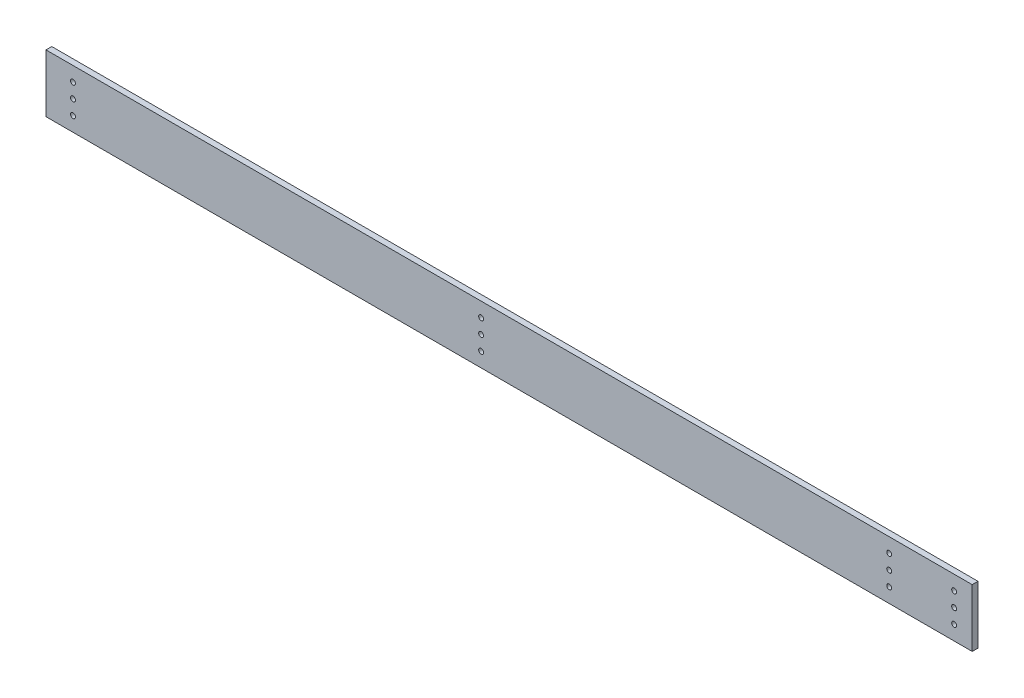
ISO-10303-21;
HEADER;
FILE_DESCRIPTION(('STEP AP214'),'2;1');
FILE_NAME('part.step','',(''),(''),'','','');
FILE_SCHEMA(('AUTOMOTIVE_DESIGN { 1 0 10303 214 1 1 1 1 }'));
ENDSEC;
DATA;
#1=APPLICATION_CONTEXT('core data for automotive mechanical design processes');
#2=APPLICATION_PROTOCOL_DEFINITION('international standard','automotive_design',2000,#1);
#3=PRODUCT_CONTEXT('',#1,'mechanical');
#4=PRODUCT('Part','Part','',(#3));
#5=PRODUCT_RELATED_PRODUCT_CATEGORY('part','',(#4));
#6=PRODUCT_DEFINITION_FORMATION('','',#4);
#7=PRODUCT_DEFINITION_CONTEXT('part definition',#1,'design');
#8=PRODUCT_DEFINITION('design','',#6,#7);
#9=PRODUCT_DEFINITION_SHAPE('','',#8);
#10=(LENGTH_UNIT() NAMED_UNIT(*) SI_UNIT(.MILLI.,.METRE.));
#11=(NAMED_UNIT(*) PLANE_ANGLE_UNIT() SI_UNIT($,.RADIAN.));
#12=(NAMED_UNIT(*) SI_UNIT($,.STERADIAN.) SOLID_ANGLE_UNIT());
#13=UNCERTAINTY_MEASURE_WITH_UNIT(LENGTH_MEASURE(1.E-05),#10,'distance_accuracy_value','');
#14=(GEOMETRIC_REPRESENTATION_CONTEXT(3) GLOBAL_UNCERTAINTY_ASSIGNED_CONTEXT((#13)) GLOBAL_UNIT_ASSIGNED_CONTEXT((#10,
#11,#12)) REPRESENTATION_CONTEXT('',''));
#15=CARTESIAN_POINT('',(0.,0.,0.));
#16=DIRECTION('',(0.,0.,1.));
#17=DIRECTION('',(1.,0.,0.));
#18=AXIS2_PLACEMENT_3D('',#15,#16,#17);
#19=CARTESIAN_POINT('',(0.,0.,3.175));
#20=DIRECTION('',(1.,0.,0.));
#21=DIRECTION('',(0.,0.,-1.));
#22=AXIS2_PLACEMENT_3D('',#19,#20,#21);
#23=PLANE('',#22);
#24=DIRECTION('',(0.,-1.,0.));
#25=VECTOR('',#24,1.);
#26=CARTESIAN_POINT('',(0.,0.,0.));
#27=LINE('',#26,#25);
#28=CARTESIAN_POINT('',(0.,31.75,0.));
#29=VERTEX_POINT('',#28);
#30=CARTESIAN_POINT('',(0.,0.,0.));
#31=VERTEX_POINT('',#30);
#32=EDGE_CURVE('E102',#29,#31,#27,.T.);
#33=ORIENTED_EDGE('',*,*,#32,.T.);
#34=DIRECTION('',(0.,0.,-1.));
#35=VECTOR('',#34,1.);
#36=CARTESIAN_POINT('',(0.,0.,3.175));
#37=LINE('',#36,#35);
#38=CARTESIAN_POINT('',(0.,0.,3.175));
#39=VERTEX_POINT('',#38);
#40=EDGE_CURVE('E11',#39,#31,#37,.T.);
#41=ORIENTED_EDGE('',*,*,#40,.F.);
#42=DIRECTION('',(0.,-1.,0.));
#43=VECTOR('',#42,1.);
#44=CARTESIAN_POINT('',(0.,0.,3.175));
#45=LINE('',#44,#43);
#46=CARTESIAN_POINT('',(0.,31.75,3.175));
#47=VERTEX_POINT('',#46);
#48=EDGE_CURVE('E90',#47,#39,#45,.T.);
#49=ORIENTED_EDGE('',*,*,#48,.F.);
#50=DIRECTION('',(0.,0.,-1.));
#51=VECTOR('',#50,1.);
#52=CARTESIAN_POINT('',(0.,31.75,3.175));
#53=LINE('',#52,#51);
#54=EDGE_CURVE('E98',#47,#29,#53,.T.);
#55=ORIENTED_EDGE('',*,*,#54,.T.);
#56=EDGE_LOOP('',(#33,#41,#49,#55));
#57=FACE_BOUND('',#56,.T.);
#58=ADVANCED_FACE('F39',(#57),#23,.F.);
#59=CARTESIAN_POINT('',(0.,0.,3.175));
#60=DIRECTION('',(0.,1.,0.));
#61=DIRECTION('',(0.,0.,1.));
#62=AXIS2_PLACEMENT_3D('',#59,#60,#61);
#63=PLANE('',#62);
#64=DIRECTION('',(1.,0.,0.));
#65=VECTOR('',#64,1.);
#66=CARTESIAN_POINT('',(0.,0.,0.));
#67=LINE('',#66,#65);
#68=CARTESIAN_POINT('',(508.,0.,0.));
#69=VERTEX_POINT('',#68);
#70=EDGE_CURVE('E94',#31,#69,#67,.T.);
#71=ORIENTED_EDGE('',*,*,#70,.T.);
#72=DIRECTION('',(0.,0.,-1.));
#73=VECTOR('',#72,1.);
#74=CARTESIAN_POINT('',(508.,0.,3.175));
#75=LINE('',#74,#73);
#76=CARTESIAN_POINT('',(508.,0.,3.175));
#77=VERTEX_POINT('',#76);
#78=EDGE_CURVE('E47',#77,#69,#75,.T.);
#79=ORIENTED_EDGE('',*,*,#78,.F.);
#80=DIRECTION('',(1.,0.,0.));
#81=VECTOR('',#80,1.);
#82=CARTESIAN_POINT('',(0.,0.,3.175));
#83=LINE('',#82,#81);
#84=EDGE_CURVE('E85',#39,#77,#83,.T.);
#85=ORIENTED_EDGE('',*,*,#84,.F.);
#86=ORIENTED_EDGE('',*,*,#40,.T.);
#87=EDGE_LOOP('',(#71,#79,#85,#86));
#88=FACE_BOUND('',#87,.T.);
#89=ADVANCED_FACE('F93',(#88),#63,.F.);
#90=CARTESIAN_POINT('',(508.,0.,3.175));
#91=DIRECTION('',(-1.,0.,0.));
#92=DIRECTION('',(0.,0.,1.));
#93=AXIS2_PLACEMENT_3D('',#90,#91,#92);
#94=PLANE('',#93);
#95=DIRECTION('',(0.,1.,0.));
#96=VECTOR('',#95,1.);
#97=CARTESIAN_POINT('',(508.,0.,0.));
#98=LINE('',#97,#96);
#99=CARTESIAN_POINT('',(508.,31.75,0.));
#100=VERTEX_POINT('',#99);
#101=EDGE_CURVE('E72',#69,#100,#98,.T.);
#102=ORIENTED_EDGE('',*,*,#101,.T.);
#103=DIRECTION('',(0.,0.,-1.));
#104=VECTOR('',#103,1.);
#105=CARTESIAN_POINT('',(508.,31.75,3.175));
#106=LINE('',#105,#104);
#107=CARTESIAN_POINT('',(508.,31.75,3.175));
#108=VERTEX_POINT('',#107);
#109=EDGE_CURVE('E95',#108,#100,#106,.T.);
#110=ORIENTED_EDGE('',*,*,#109,.F.);
#111=DIRECTION('',(0.,1.,0.));
#112=VECTOR('',#111,1.);
#113=CARTESIAN_POINT('',(508.,0.,3.175));
#114=LINE('',#113,#112);
#115=EDGE_CURVE('E88',#77,#108,#114,.T.);
#116=ORIENTED_EDGE('',*,*,#115,.F.);
#117=ORIENTED_EDGE('',*,*,#78,.T.);
#118=EDGE_LOOP('',(#102,#110,#116,#117));
#119=FACE_BOUND('',#118,.T.);
#120=ADVANCED_FACE('F96',(#119),#94,.F.);
#121=CARTESIAN_POINT('',(0.,31.75,3.175));
#122=DIRECTION('',(0.,-1.,0.));
#123=DIRECTION('',(0.,0.,-1.));
#124=AXIS2_PLACEMENT_3D('',#121,#122,#123);
#125=PLANE('',#124);
#126=DIRECTION('',(-1.,0.,0.));
#127=VECTOR('',#126,1.);
#128=CARTESIAN_POINT('',(0.,31.75,0.));
#129=LINE('',#128,#127);
#130=EDGE_CURVE('E78',#100,#29,#129,.T.);
#131=ORIENTED_EDGE('',*,*,#130,.T.);
#132=ORIENTED_EDGE('',*,*,#54,.F.);
#133=DIRECTION('',(-1.,0.,0.));
#134=VECTOR('',#133,1.);
#135=CARTESIAN_POINT('',(0.,31.75,3.175));
#136=LINE('',#135,#134);
#137=EDGE_CURVE('E55',#108,#47,#136,.T.);
#138=ORIENTED_EDGE('',*,*,#137,.F.);
#139=ORIENTED_EDGE('',*,*,#109,.T.);
#140=EDGE_LOOP('',(#131,#132,#138,#139));
#141=FACE_BOUND('',#140,.T.);
#142=ADVANCED_FACE('F110',(#141),#125,.F.);
#143=CARTESIAN_POINT('',(0.,0.,3.175));
#144=DIRECTION('',(0.,0.,-1.));
#145=DIRECTION('',(-1.,0.,0.));
#146=AXIS2_PLACEMENT_3D('',#143,#144,#145);
#147=PLANE('',#146);
#148=CARTESIAN_POINT('',(462.4832,7.9248,3.175));
#149=DIRECTION('',(0.,0.,1.));
#150=DIRECTION('',(1.,0.,0.));
#151=AXIS2_PLACEMENT_3D('',#148,#149,#150);
#152=CIRCLE('',#151,1.35890000000001);
#153=CARTESIAN_POINT('',(463.8421,7.9248,3.175));
#154=VERTEX_POINT('',#153);
#155=EDGE_CURVE('E126',#154,#154,#152,.T.);
#156=ORIENTED_EDGE('',*,*,#155,.F.);
#157=EDGE_LOOP('',(#156));
#158=FACE_BOUND('',#157,.T.);
#159=CARTESIAN_POINT('',(498.094,23.8252,3.175));
#160=DIRECTION('',(0.,0.,1.));
#161=DIRECTION('',(1.,0.,0.));
#162=AXIS2_PLACEMENT_3D('',#159,#160,#161);
#163=CIRCLE('',#162,1.35890000000001);
#164=CARTESIAN_POINT('',(499.4529,23.8252,3.175));
#165=VERTEX_POINT('',#164);
#166=EDGE_CURVE('E149',#165,#165,#163,.T.);
#167=ORIENTED_EDGE('',*,*,#166,.F.);
#168=EDGE_LOOP('',(#167));
#169=FACE_BOUND('',#168,.T.);
#170=CARTESIAN_POINT('',(498.094,15.875,3.175));
#171=DIRECTION('',(0.,0.,1.));
#172=DIRECTION('',(1.,0.,0.));
#173=AXIS2_PLACEMENT_3D('',#170,#171,#172);
#174=CIRCLE('',#173,1.35890000000001);
#175=CARTESIAN_POINT('',(499.4529,15.875,3.175));
#176=VERTEX_POINT('',#175);
#177=EDGE_CURVE('E150',#176,#176,#174,.T.);
#178=ORIENTED_EDGE('',*,*,#177,.F.);
#179=EDGE_LOOP('',(#178));
#180=FACE_BOUND('',#179,.T.);
#181=CARTESIAN_POINT('',(498.094,7.9248,3.175));
#182=DIRECTION('',(0.,0.,1.));
#183=DIRECTION('',(1.,0.,0.));
#184=AXIS2_PLACEMENT_3D('',#181,#182,#183);
#185=CIRCLE('',#184,1.35890000000001);
#186=CARTESIAN_POINT('',(499.4529,7.9248,3.175));
#187=VERTEX_POINT('',#186);
#188=EDGE_CURVE('E161',#187,#187,#185,.T.);
#189=ORIENTED_EDGE('',*,*,#188,.F.);
#190=EDGE_LOOP('',(#189));
#191=FACE_BOUND('',#190,.T.);
#192=CARTESIAN_POINT('',(462.4832,15.875,3.175));
#193=DIRECTION('',(0.,0.,1.));
#194=DIRECTION('',(1.,0.,0.));
#195=AXIS2_PLACEMENT_3D('',#192,#193,#194);
#196=CIRCLE('',#195,1.35890000000001);
#197=CARTESIAN_POINT('',(463.8421,15.875,3.175));
#198=VERTEX_POINT('',#197);
#199=EDGE_CURVE('E125',#198,#198,#196,.T.);
#200=ORIENTED_EDGE('',*,*,#199,.F.);
#201=EDGE_LOOP('',(#200));
#202=FACE_BOUND('',#201,.T.);
#203=CARTESIAN_POINT('',(462.4832,23.8252,3.175));
#204=DIRECTION('',(0.,0.,1.));
#205=DIRECTION('',(1.,0.,0.));
#206=AXIS2_PLACEMENT_3D('',#203,#204,#205);
#207=CIRCLE('',#206,1.35890000000001);
#208=CARTESIAN_POINT('',(463.8421,23.8252,3.175));
#209=VERTEX_POINT('',#208);
#210=EDGE_CURVE('E132',#209,#209,#207,.T.);
#211=ORIENTED_EDGE('',*,*,#210,.F.);
#212=EDGE_LOOP('',(#211));
#213=FACE_BOUND('',#212,.T.);
#214=CARTESIAN_POINT('',(14.8082,7.9248,3.175));
#215=DIRECTION('',(0.,0.,1.));
#216=DIRECTION('',(1.,0.,0.));
#217=AXIS2_PLACEMENT_3D('',#214,#215,#216);
#218=CIRCLE('',#217,1.3589);
#219=CARTESIAN_POINT('',(16.1671,7.9248,3.175));
#220=VERTEX_POINT('',#219);
#221=EDGE_CURVE('E138',#220,#220,#218,.T.);
#222=ORIENTED_EDGE('',*,*,#221,.F.);
#223=EDGE_LOOP('',(#222));
#224=FACE_BOUND('',#223,.T.);
#225=CARTESIAN_POINT('',(14.8082,15.875,3.175));
#226=DIRECTION('',(0.,0.,1.));
#227=DIRECTION('',(1.,0.,0.));
#228=AXIS2_PLACEMENT_3D('',#225,#226,#227);
#229=CIRCLE('',#228,1.3589);
#230=CARTESIAN_POINT('',(16.1671,15.875,3.175));
#231=VERTEX_POINT('',#230);
#232=EDGE_CURVE('E119',#231,#231,#229,.T.);
#233=ORIENTED_EDGE('',*,*,#232,.F.);
#234=EDGE_LOOP('',(#233));
#235=FACE_BOUND('',#234,.T.);
#236=CARTESIAN_POINT('',(238.6584,23.8252,3.175));
#237=DIRECTION('',(0.,0.,1.));
#238=DIRECTION('',(1.,0.,0.));
#239=AXIS2_PLACEMENT_3D('',#236,#237,#238);
#240=CIRCLE('',#239,1.35890000000001);
#241=CARTESIAN_POINT('',(240.0173,23.8252,3.175));
#242=VERTEX_POINT('',#241);
#243=EDGE_CURVE('E162',#242,#242,#240,.T.);
#244=ORIENTED_EDGE('',*,*,#243,.F.);
#245=EDGE_LOOP('',(#244));
#246=FACE_BOUND('',#245,.T.);
#247=CARTESIAN_POINT('',(238.6584,15.875,3.175));
#248=DIRECTION('',(0.,0.,1.));
#249=DIRECTION('',(1.,0.,0.));
#250=AXIS2_PLACEMENT_3D('',#247,#248,#249);
#251=CIRCLE('',#250,1.35890000000001);
#252=CARTESIAN_POINT('',(240.0173,15.875,3.175));
#253=VERTEX_POINT('',#252);
#254=EDGE_CURVE('E179',#253,#253,#251,.T.);
#255=ORIENTED_EDGE('',*,*,#254,.F.);
#256=EDGE_LOOP('',(#255));
#257=FACE_BOUND('',#256,.T.);
#258=CARTESIAN_POINT('',(238.6584,7.9248,3.175));
#259=DIRECTION('',(0.,0.,1.));
#260=DIRECTION('',(1.,0.,0.));
#261=AXIS2_PLACEMENT_3D('',#258,#259,#260);
#262=CIRCLE('',#261,1.35890000000001);
#263=CARTESIAN_POINT('',(240.0173,7.9248,3.175));
#264=VERTEX_POINT('',#263);
#265=EDGE_CURVE('E173',#264,#264,#262,.T.);
#266=ORIENTED_EDGE('',*,*,#265,.F.);
#267=EDGE_LOOP('',(#266));
#268=FACE_BOUND('',#267,.T.);
#269=CARTESIAN_POINT('',(14.8082,23.8252,3.175));
#270=DIRECTION('',(0.,0.,1.));
#271=DIRECTION('',(1.,0.,0.));
#272=AXIS2_PLACEMENT_3D('',#269,#270,#271);
#273=CIRCLE('',#272,1.3589);
#274=CARTESIAN_POINT('',(16.1671,23.8252,3.175));
#275=VERTEX_POINT('',#274);
#276=EDGE_CURVE('E116',#275,#275,#273,.T.);
#277=ORIENTED_EDGE('',*,*,#276,.F.);
#278=EDGE_LOOP('',(#277));
#279=FACE_BOUND('',#278,.T.);
#280=ORIENTED_EDGE('',*,*,#48,.T.);
#281=ORIENTED_EDGE('',*,*,#84,.T.);
#282=ORIENTED_EDGE('',*,*,#115,.T.);
#283=ORIENTED_EDGE('',*,*,#137,.T.);
#284=EDGE_LOOP('',(#280,#281,#282,#283));
#285=FACE_BOUND('',#284,.T.);
#286=ADVANCED_FACE('F86',(#158,#169,#180,#191,#202,#213,#224,#235,#246,#257,#268,#279,#285),
#147,.F.);
#287=CARTESIAN_POINT('',(0.,0.,0.));
#288=DIRECTION('',(0.,0.,-1.));
#289=DIRECTION('',(-1.,0.,0.));
#290=AXIS2_PLACEMENT_3D('',#287,#288,#289);
#291=PLANE('',#290);
#292=CARTESIAN_POINT('',(462.4832,7.9248,0.));
#293=DIRECTION('',(0.,0.,1.));
#294=DIRECTION('',(1.,0.,0.));
#295=AXIS2_PLACEMENT_3D('',#292,#293,#294);
#296=CIRCLE('',#295,1.35890000000001);
#297=CARTESIAN_POINT('',(463.8421,7.9248,0.));
#298=VERTEX_POINT('',#297);
#299=EDGE_CURVE('E153',#298,#298,#296,.T.);
#300=ORIENTED_EDGE('',*,*,#299,.T.);
#301=EDGE_LOOP('',(#300));
#302=FACE_BOUND('',#301,.T.);
#303=CARTESIAN_POINT('',(498.094,23.8252,0.));
#304=DIRECTION('',(0.,0.,1.));
#305=DIRECTION('',(1.,0.,0.));
#306=AXIS2_PLACEMENT_3D('',#303,#304,#305);
#307=CIRCLE('',#306,1.35890000000001);
#308=CARTESIAN_POINT('',(499.4529,23.8252,0.));
#309=VERTEX_POINT('',#308);
#310=EDGE_CURVE('E146',#309,#309,#307,.T.);
#311=ORIENTED_EDGE('',*,*,#310,.T.);
#312=EDGE_LOOP('',(#311));
#313=FACE_BOUND('',#312,.T.);
#314=CARTESIAN_POINT('',(498.094,15.875,0.));
#315=DIRECTION('',(0.,0.,1.));
#316=DIRECTION('',(1.,0.,0.));
#317=AXIS2_PLACEMENT_3D('',#314,#315,#316);
#318=CIRCLE('',#317,1.35890000000001);
#319=CARTESIAN_POINT('',(499.4529,15.875,0.));
#320=VERTEX_POINT('',#319);
#321=EDGE_CURVE('E165',#320,#320,#318,.T.);
#322=ORIENTED_EDGE('',*,*,#321,.T.);
#323=EDGE_LOOP('',(#322));
#324=FACE_BOUND('',#323,.T.);
#325=CARTESIAN_POINT('',(498.094,7.9248,0.));
#326=DIRECTION('',(0.,0.,1.));
#327=DIRECTION('',(1.,0.,0.));
#328=AXIS2_PLACEMENT_3D('',#325,#326,#327);
#329=CIRCLE('',#328,1.35890000000001);
#330=CARTESIAN_POINT('',(499.4529,7.9248,0.));
#331=VERTEX_POINT('',#330);
#332=EDGE_CURVE('E158',#331,#331,#329,.T.);
#333=ORIENTED_EDGE('',*,*,#332,.T.);
#334=EDGE_LOOP('',(#333));
#335=FACE_BOUND('',#334,.T.);
#336=CARTESIAN_POINT('',(462.4832,15.875,0.));
#337=DIRECTION('',(0.,0.,1.));
#338=DIRECTION('',(1.,0.,0.));
#339=AXIS2_PLACEMENT_3D('',#336,#337,#338);
#340=CIRCLE('',#339,1.35890000000001);
#341=CARTESIAN_POINT('',(463.8421,15.875,0.));
#342=VERTEX_POINT('',#341);
#343=EDGE_CURVE('E122',#342,#342,#340,.T.);
#344=ORIENTED_EDGE('',*,*,#343,.T.);
#345=EDGE_LOOP('',(#344));
#346=FACE_BOUND('',#345,.T.);
#347=CARTESIAN_POINT('',(462.4832,23.8252,0.));
#348=DIRECTION('',(0.,0.,1.));
#349=DIRECTION('',(1.,0.,0.));
#350=AXIS2_PLACEMENT_3D('',#347,#348,#349);
#351=CIRCLE('',#350,1.35890000000001);
#352=CARTESIAN_POINT('',(463.8421,23.8252,0.));
#353=VERTEX_POINT('',#352);
#354=EDGE_CURVE('E129',#353,#353,#351,.T.);
#355=ORIENTED_EDGE('',*,*,#354,.T.);
#356=EDGE_LOOP('',(#355));
#357=FACE_BOUND('',#356,.T.);
#358=CARTESIAN_POINT('',(14.8082,7.9248,0.));
#359=DIRECTION('',(0.,0.,1.));
#360=DIRECTION('',(1.,0.,0.));
#361=AXIS2_PLACEMENT_3D('',#358,#359,#360);
#362=CIRCLE('',#361,1.3589);
#363=CARTESIAN_POINT('',(16.1671,7.9248,0.));
#364=VERTEX_POINT('',#363);
#365=EDGE_CURVE('E135',#364,#364,#362,.T.);
#366=ORIENTED_EDGE('',*,*,#365,.T.);
#367=EDGE_LOOP('',(#366));
#368=FACE_BOUND('',#367,.T.);
#369=CARTESIAN_POINT('',(14.8082,15.875,0.));
#370=DIRECTION('',(0.,0.,1.));
#371=DIRECTION('',(1.,0.,0.));
#372=AXIS2_PLACEMENT_3D('',#369,#370,#371);
#373=CIRCLE('',#372,1.3589);
#374=CARTESIAN_POINT('',(16.1671,15.875,0.));
#375=VERTEX_POINT('',#374);
#376=EDGE_CURVE('E141',#375,#375,#373,.T.);
#377=ORIENTED_EDGE('',*,*,#376,.T.);
#378=EDGE_LOOP('',(#377));
#379=FACE_BOUND('',#378,.T.);
#380=CARTESIAN_POINT('',(238.6584,23.8252,0.));
#381=DIRECTION('',(0.,0.,1.));
#382=DIRECTION('',(1.,0.,0.));
#383=AXIS2_PLACEMENT_3D('',#380,#381,#382);
#384=CIRCLE('',#383,1.35890000000001);
#385=CARTESIAN_POINT('',(240.0173,23.8252,0.));
#386=VERTEX_POINT('',#385);
#387=EDGE_CURVE('E182',#386,#386,#384,.T.);
#388=ORIENTED_EDGE('',*,*,#387,.T.);
#389=EDGE_LOOP('',(#388));
#390=FACE_BOUND('',#389,.T.);
#391=CARTESIAN_POINT('',(238.6584,15.875,0.));
#392=DIRECTION('',(0.,0.,1.));
#393=DIRECTION('',(1.,0.,0.));
#394=AXIS2_PLACEMENT_3D('',#391,#392,#393);
#395=CIRCLE('',#394,1.35890000000001);
#396=CARTESIAN_POINT('',(240.0173,15.875,0.));
#397=VERTEX_POINT('',#396);
#398=EDGE_CURVE('E176',#397,#397,#395,.T.);
#399=ORIENTED_EDGE('',*,*,#398,.T.);
#400=EDGE_LOOP('',(#399));
#401=FACE_BOUND('',#400,.T.);
#402=CARTESIAN_POINT('',(238.6584,7.9248,0.));
#403=DIRECTION('',(0.,0.,1.));
#404=DIRECTION('',(1.,0.,0.));
#405=AXIS2_PLACEMENT_3D('',#402,#403,#404);
#406=CIRCLE('',#405,1.35890000000001);
#407=CARTESIAN_POINT('',(240.0173,7.9248,0.));
#408=VERTEX_POINT('',#407);
#409=EDGE_CURVE('E170',#408,#408,#406,.T.);
#410=ORIENTED_EDGE('',*,*,#409,.T.);
#411=EDGE_LOOP('',(#410));
#412=FACE_BOUND('',#411,.T.);
#413=CARTESIAN_POINT('',(14.8082,23.8252,0.));
#414=DIRECTION('',(0.,0.,1.));
#415=DIRECTION('',(1.,0.,0.));
#416=AXIS2_PLACEMENT_3D('',#413,#414,#415);
#417=CIRCLE('',#416,1.3589);
#418=CARTESIAN_POINT('',(16.1671,23.8252,0.));
#419=VERTEX_POINT('',#418);
#420=EDGE_CURVE('E105',#419,#419,#417,.T.);
#421=ORIENTED_EDGE('',*,*,#420,.T.);
#422=EDGE_LOOP('',(#421));
#423=FACE_BOUND('',#422,.T.);
#424=ORIENTED_EDGE('',*,*,#32,.F.);
#425=ORIENTED_EDGE('',*,*,#130,.F.);
#426=ORIENTED_EDGE('',*,*,#101,.F.);
#427=ORIENTED_EDGE('',*,*,#70,.F.);
#428=EDGE_LOOP('',(#424,#425,#426,#427));
#429=FACE_BOUND('',#428,.T.);
#430=ADVANCED_FACE('F113',(#302,#313,#324,#335,#346,#357,#368,#379,#390,#401,#412,#423,#429),
#291,.T.);
#431=CARTESIAN_POINT('',(14.8082,23.8252,0.));
#432=DIRECTION('',(0.,0.,1.));
#433=DIRECTION('',(1.,0.,0.));
#434=AXIS2_PLACEMENT_3D('',#431,#432,#433);
#435=CYLINDRICAL_SURFACE('',#434,1.3589);
#436=ORIENTED_EDGE('',*,*,#420,.F.);
#437=EDGE_LOOP('',(#436));
#438=FACE_BOUND('',#437,.T.);
#439=ORIENTED_EDGE('',*,*,#276,.T.);
#440=EDGE_LOOP('',(#439));
#441=FACE_BOUND('',#440,.T.);
#442=ADVANCED_FACE('F200',(#438,#441),#435,.F.);
#443=CARTESIAN_POINT('',(238.6584,7.9248,0.));
#444=DIRECTION('',(0.,0.,1.));
#445=DIRECTION('',(1.,0.,0.));
#446=AXIS2_PLACEMENT_3D('',#443,#444,#445);
#447=CYLINDRICAL_SURFACE('',#446,1.35890000000001);
#448=ORIENTED_EDGE('',*,*,#409,.F.);
#449=EDGE_LOOP('',(#448));
#450=FACE_BOUND('',#449,.T.);
#451=ORIENTED_EDGE('',*,*,#265,.T.);
#452=EDGE_LOOP('',(#451));
#453=FACE_BOUND('',#452,.T.);
#454=ADVANCED_FACE('F202',(#450,#453),#447,.F.);
#455=CARTESIAN_POINT('',(238.6584,15.875,0.));
#456=DIRECTION('',(0.,0.,1.));
#457=DIRECTION('',(1.,0.,0.));
#458=AXIS2_PLACEMENT_3D('',#455,#456,#457);
#459=CYLINDRICAL_SURFACE('',#458,1.35890000000001);
#460=ORIENTED_EDGE('',*,*,#398,.F.);
#461=EDGE_LOOP('',(#460));
#462=FACE_BOUND('',#461,.T.);
#463=ORIENTED_EDGE('',*,*,#254,.T.);
#464=EDGE_LOOP('',(#463));
#465=FACE_BOUND('',#464,.T.);
#466=ADVANCED_FACE('F209',(#462,#465),#459,.F.);
#467=CARTESIAN_POINT('',(238.6584,23.8252,0.));
#468=DIRECTION('',(0.,0.,1.));
#469=DIRECTION('',(1.,0.,0.));
#470=AXIS2_PLACEMENT_3D('',#467,#468,#469);
#471=CYLINDRICAL_SURFACE('',#470,1.35890000000001);
#472=ORIENTED_EDGE('',*,*,#387,.F.);
#473=EDGE_LOOP('',(#472));
#474=FACE_BOUND('',#473,.T.);
#475=ORIENTED_EDGE('',*,*,#243,.T.);
#476=EDGE_LOOP('',(#475));
#477=FACE_BOUND('',#476,.T.);
#478=ADVANCED_FACE('F188',(#474,#477),#471,.F.);
#479=CARTESIAN_POINT('',(14.8082,15.875,0.));
#480=DIRECTION('',(0.,0.,1.));
#481=DIRECTION('',(1.,0.,0.));
#482=AXIS2_PLACEMENT_3D('',#479,#480,#481);
#483=CYLINDRICAL_SURFACE('',#482,1.3589);
#484=ORIENTED_EDGE('',*,*,#376,.F.);
#485=EDGE_LOOP('',(#484));
#486=FACE_BOUND('',#485,.T.);
#487=ORIENTED_EDGE('',*,*,#232,.T.);
#488=EDGE_LOOP('',(#487));
#489=FACE_BOUND('',#488,.T.);
#490=ADVANCED_FACE('F276',(#486,#489),#483,.F.);
#491=CARTESIAN_POINT('',(14.8082,7.9248,0.));
#492=DIRECTION('',(0.,0.,1.));
#493=DIRECTION('',(1.,0.,0.));
#494=AXIS2_PLACEMENT_3D('',#491,#492,#493);
#495=CYLINDRICAL_SURFACE('',#494,1.3589);
#496=ORIENTED_EDGE('',*,*,#365,.F.);
#497=EDGE_LOOP('',(#496));
#498=FACE_BOUND('',#497,.T.);
#499=ORIENTED_EDGE('',*,*,#221,.T.);
#500=EDGE_LOOP('',(#499));
#501=FACE_BOUND('',#500,.T.);
#502=ADVANCED_FACE('F288',(#498,#501),#495,.F.);
#503=CARTESIAN_POINT('',(462.4832,23.8252,0.));
#504=DIRECTION('',(0.,0.,1.));
#505=DIRECTION('',(1.,0.,0.));
#506=AXIS2_PLACEMENT_3D('',#503,#504,#505);
#507=CYLINDRICAL_SURFACE('',#506,1.35890000000001);
#508=ORIENTED_EDGE('',*,*,#354,.F.);
#509=EDGE_LOOP('',(#508));
#510=FACE_BOUND('',#509,.T.);
#511=ORIENTED_EDGE('',*,*,#210,.T.);
#512=EDGE_LOOP('',(#511));
#513=FACE_BOUND('',#512,.T.);
#514=ADVANCED_FACE('F300',(#510,#513),#507,.F.);
#515=CARTESIAN_POINT('',(462.4832,15.875,0.));
#516=DIRECTION('',(0.,0.,1.));
#517=DIRECTION('',(1.,0.,0.));
#518=AXIS2_PLACEMENT_3D('',#515,#516,#517);
#519=CYLINDRICAL_SURFACE('',#518,1.35890000000001);
#520=ORIENTED_EDGE('',*,*,#343,.F.);
#521=EDGE_LOOP('',(#520));
#522=FACE_BOUND('',#521,.T.);
#523=ORIENTED_EDGE('',*,*,#199,.T.);
#524=EDGE_LOOP('',(#523));
#525=FACE_BOUND('',#524,.T.);
#526=ADVANCED_FACE('F312',(#522,#525),#519,.F.);
#527=CARTESIAN_POINT('',(498.094,7.9248,0.));
#528=DIRECTION('',(0.,0.,1.));
#529=DIRECTION('',(1.,0.,0.));
#530=AXIS2_PLACEMENT_3D('',#527,#528,#529);
#531=CYLINDRICAL_SURFACE('',#530,1.35890000000001);
#532=ORIENTED_EDGE('',*,*,#332,.F.);
#533=EDGE_LOOP('',(#532));
#534=FACE_BOUND('',#533,.T.);
#535=ORIENTED_EDGE('',*,*,#188,.T.);
#536=EDGE_LOOP('',(#535));
#537=FACE_BOUND('',#536,.T.);
#538=ADVANCED_FACE('F324',(#534,#537),#531,.F.);
#539=CARTESIAN_POINT('',(498.094,15.875,0.));
#540=DIRECTION('',(0.,0.,1.));
#541=DIRECTION('',(1.,0.,0.));
#542=AXIS2_PLACEMENT_3D('',#539,#540,#541);
#543=CYLINDRICAL_SURFACE('',#542,1.35890000000001);
#544=ORIENTED_EDGE('',*,*,#321,.F.);
#545=EDGE_LOOP('',(#544));
#546=FACE_BOUND('',#545,.T.);
#547=ORIENTED_EDGE('',*,*,#177,.T.);
#548=EDGE_LOOP('',(#547));
#549=FACE_BOUND('',#548,.T.);
#550=ADVANCED_FACE('F335',(#546,#549),#543,.F.);
#551=CARTESIAN_POINT('',(498.094,23.8252,0.));
#552=DIRECTION('',(0.,0.,1.));
#553=DIRECTION('',(1.,0.,0.));
#554=AXIS2_PLACEMENT_3D('',#551,#552,#553);
#555=CYLINDRICAL_SURFACE('',#554,1.35890000000001);
#556=ORIENTED_EDGE('',*,*,#310,.F.);
#557=EDGE_LOOP('',(#556));
#558=FACE_BOUND('',#557,.T.);
#559=ORIENTED_EDGE('',*,*,#166,.T.);
#560=EDGE_LOOP('',(#559));
#561=FACE_BOUND('',#560,.T.);
#562=ADVANCED_FACE('F347',(#558,#561),#555,.F.);
#563=CARTESIAN_POINT('',(462.4832,7.9248,0.));
#564=DIRECTION('',(0.,0.,1.));
#565=DIRECTION('',(1.,0.,0.));
#566=AXIS2_PLACEMENT_3D('',#563,#564,#565);
#567=CYLINDRICAL_SURFACE('',#566,1.35890000000001);
#568=ORIENTED_EDGE('',*,*,#299,.F.);
#569=EDGE_LOOP('',(#568));
#570=FACE_BOUND('',#569,.T.);
#571=ORIENTED_EDGE('',*,*,#155,.T.);
#572=EDGE_LOOP('',(#571));
#573=FACE_BOUND('',#572,.T.);
#574=ADVANCED_FACE('F359',(#570,#573),#567,.F.);
#575=CLOSED_SHELL('',(#58,#89,#120,#142,#286,#430,#442,#454,#466,#478,#490,#502,#514,#526,#538,
#550,#562,#574));
#576=MANIFOLD_SOLID_BREP('B2',#575);
#577=ADVANCED_BREP_SHAPE_REPRESENTATION('',(#18,#576),#14);
#578=SHAPE_DEFINITION_REPRESENTATION(#9,#577);
ENDSEC;
END-ISO-10303-21;
